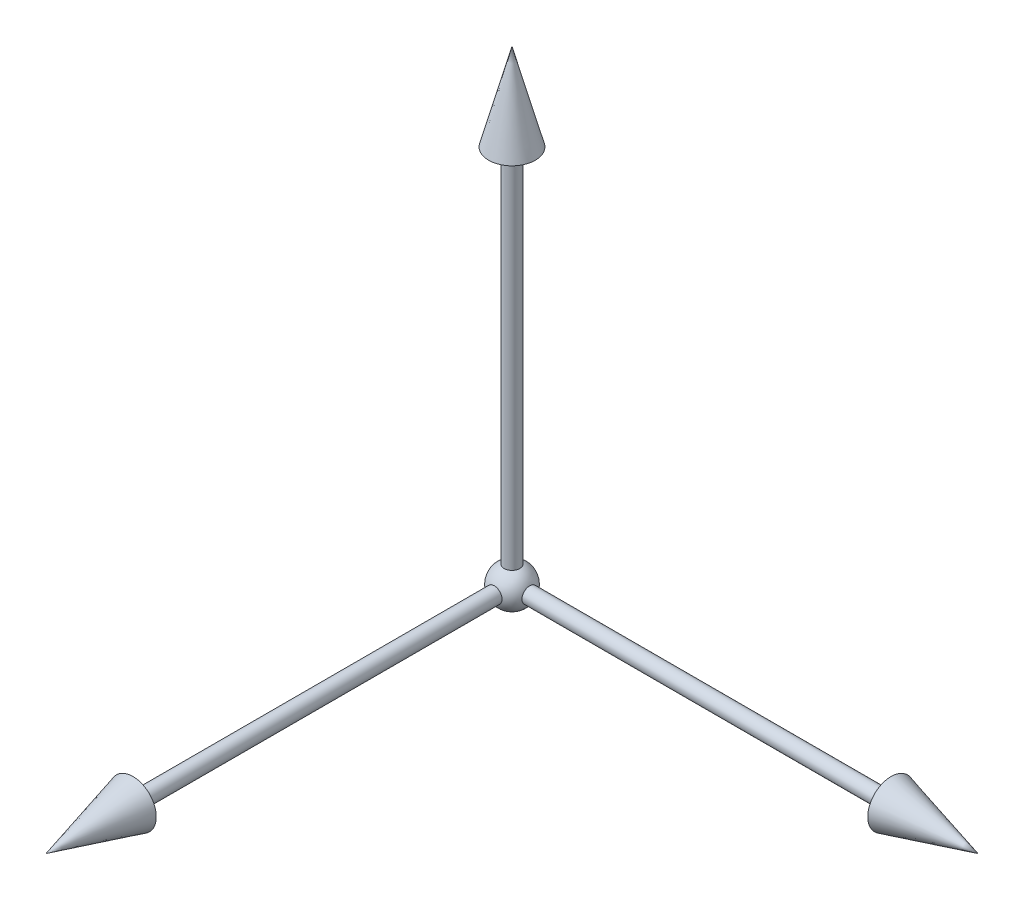
ISO-10303-21;
HEADER;
FILE_DESCRIPTION(('STEP AP214'),'2;1');
FILE_NAME('part.step','',(''),(''),'','','');
FILE_SCHEMA(('AUTOMOTIVE_DESIGN { 1 0 10303 214 1 1 1 1 }'));
ENDSEC;
DATA;
#1=APPLICATION_CONTEXT('core data for automotive mechanical design processes');
#2=APPLICATION_PROTOCOL_DEFINITION('international standard','automotive_design',2000,#1);
#3=PRODUCT_CONTEXT('',#1,'mechanical');
#4=PRODUCT('Part','Part','',(#3));
#5=PRODUCT_RELATED_PRODUCT_CATEGORY('part','',(#4));
#6=PRODUCT_DEFINITION_FORMATION('','',#4);
#7=PRODUCT_DEFINITION_CONTEXT('part definition',#1,'design');
#8=PRODUCT_DEFINITION('design','',#6,#7);
#9=PRODUCT_DEFINITION_SHAPE('','',#8);
#10=(LENGTH_UNIT() NAMED_UNIT(*) SI_UNIT(.MILLI.,.METRE.));
#11=(NAMED_UNIT(*) PLANE_ANGLE_UNIT() SI_UNIT($,.RADIAN.));
#12=(NAMED_UNIT(*) SI_UNIT($,.STERADIAN.) SOLID_ANGLE_UNIT());
#13=UNCERTAINTY_MEASURE_WITH_UNIT(LENGTH_MEASURE(1.E-05),#10,'distance_accuracy_value','');
#14=(GEOMETRIC_REPRESENTATION_CONTEXT(3) GLOBAL_UNCERTAINTY_ASSIGNED_CONTEXT((#13)) GLOBAL_UNIT_ASSIGNED_CONTEXT((#10,
#11,#12)) REPRESENTATION_CONTEXT('',''));
#15=CARTESIAN_POINT('',(0.,0.,0.));
#16=DIRECTION('',(0.,0.,1.));
#17=DIRECTION('',(1.,0.,0.));
#18=AXIS2_PLACEMENT_3D('',#15,#16,#17);
#19=CARTESIAN_POINT('',(0.,0.,0.));
#20=DIRECTION('',(0.,1.,0.));
#21=DIRECTION('',(1.,0.,0.));
#22=AXIS2_PLACEMENT_3D('',#19,#20,#21);
#23=SPHERICAL_SURFACE('',#22,1.25000000000001);
#24=CARTESIAN_POINT('',(0.,1.25000000000001,0.));
#25=VERTEX_POINT('',#24);
#26=VERTEX_LOOP('',#25);
#27=FACE_BOUND('',#26,.T.);
#28=ADVANCED_FACE('F43',(#27),#23,.T.);
#29=CLOSED_SHELL('',(#28));
#30=MANIFOLD_SOLID_BREP('B2',#29);
#31=CARTESIAN_POINT('',(0.,0.,0.));
#32=DIRECTION('',(-1.,0.,0.));
#33=DIRECTION('',(0.,0.,-1.));
#34=AXIS2_PLACEMENT_3D('',#31,#32,#33);
#35=PLANE('',#34);
#36=CARTESIAN_POINT('',(0.,0.,0.));
#37=DIRECTION('',(-1.,0.,0.));
#38=DIRECTION('',(0.,0.,-1.));
#39=AXIS2_PLACEMENT_3D('',#36,#37,#38);
#40=CIRCLE('',#39,0.500000000000014);
#41=CARTESIAN_POINT('',(0.,0.,-0.500000000000014));
#42=VERTEX_POINT('',#41);
#43=EDGE_CURVE('E87',#42,#42,#40,.T.);
#44=ORIENTED_EDGE('',*,*,#43,.T.);
#45=EDGE_LOOP('',(#44));
#46=FACE_BOUND('',#45,.T.);
#47=ADVANCED_FACE('F65',(#46),#35,.T.);
#48=CARTESIAN_POINT('',(24.4019237886467,0.,0.));
#49=DIRECTION('',(-1.,0.,0.));
#50=DIRECTION('',(0.,0.,-1.));
#51=AXIS2_PLACEMENT_3D('',#48,#49,#50);
#52=CONICAL_SURFACE('',#51,1.5,0.261799387799151);
#53=CARTESIAN_POINT('',(30.,-1.04744440165294E-13,0.));
#54=VERTEX_POINT('',#53);
#55=VERTEX_LOOP('',#54);
#56=FACE_BOUND('',#55,.T.);
#57=CARTESIAN_POINT('',(24.4019237886467,0.,0.));
#58=DIRECTION('',(-1.,0.,0.));
#59=DIRECTION('',(0.,0.,-1.));
#60=AXIS2_PLACEMENT_3D('',#57,#58,#59);
#61=CIRCLE('',#60,1.5);
#62=CARTESIAN_POINT('',(24.4019237886467,0.,-1.5));
#63=VERTEX_POINT('',#62);
#64=EDGE_CURVE('E41',#63,#63,#61,.T.);
#65=ORIENTED_EDGE('',*,*,#64,.F.);
#66=EDGE_LOOP('',(#65));
#67=FACE_BOUND('',#66,.T.);
#68=ADVANCED_FACE('F74',(#56,#67),#52,.T.);
#69=CARTESIAN_POINT('',(24.4019237886467,-1.50000000000009,0.));
#70=DIRECTION('',(-1.,0.,0.));
#71=DIRECTION('',(0.,0.,-1.));
#72=AXIS2_PLACEMENT_3D('',#69,#70,#71);
#73=PLANE('',#72);
#74=ORIENTED_EDGE('',*,*,#64,.T.);
#75=EDGE_LOOP('',(#74));
#76=FACE_BOUND('',#75,.T.);
#77=CARTESIAN_POINT('',(24.4019237886467,0.,0.));
#78=DIRECTION('',(-1.,0.,0.));
#79=DIRECTION('',(0.,0.,-1.));
#80=AXIS2_PLACEMENT_3D('',#77,#78,#79);
#81=CIRCLE('',#80,0.500000000000006);
#82=CARTESIAN_POINT('',(24.4019237886467,0.,-0.500000000000006));
#83=VERTEX_POINT('',#82);
#84=EDGE_CURVE('E71',#83,#83,#81,.T.);
#85=ORIENTED_EDGE('',*,*,#84,.F.);
#86=EDGE_LOOP('',(#85));
#87=FACE_BOUND('',#86,.T.);
#88=ADVANCED_FACE('F77',(#76,#87),#73,.T.);
#89=CARTESIAN_POINT('',(0.,0.,0.));
#90=DIRECTION('',(-1.,0.,0.));
#91=DIRECTION('',(0.,0.,-1.));
#92=AXIS2_PLACEMENT_3D('',#89,#90,#91);
#93=CYLINDRICAL_SURFACE('',#92,0.50000000000001);
#94=ORIENTED_EDGE('',*,*,#84,.T.);
#95=EDGE_LOOP('',(#94));
#96=FACE_BOUND('',#95,.T.);
#97=ORIENTED_EDGE('',*,*,#43,.F.);
#98=EDGE_LOOP('',(#97));
#99=FACE_BOUND('',#98,.T.);
#100=ADVANCED_FACE('F82',(#96,#99),#93,.T.);
#101=CLOSED_SHELL('',(#47,#68,#88,#100));
#102=MANIFOLD_SOLID_BREP('B6',#101);
#103=CARTESIAN_POINT('',(0.,0.,0.));
#104=DIRECTION('',(0.,0.,-1.));
#105=DIRECTION('',(0.,1.,0.));
#106=AXIS2_PLACEMENT_3D('',#103,#104,#105);
#107=PLANE('',#106);
#108=CARTESIAN_POINT('',(0.,0.,0.));
#109=DIRECTION('',(0.,0.,-1.));
#110=DIRECTION('',(0.,1.,0.));
#111=AXIS2_PLACEMENT_3D('',#108,#109,#110);
#112=CIRCLE('',#111,0.500000000000014);
#113=CARTESIAN_POINT('',(0.,0.500000000000014,0.));
#114=VERTEX_POINT('',#113);
#115=EDGE_CURVE('E174',#114,#114,#112,.T.);
#116=ORIENTED_EDGE('',*,*,#115,.T.);
#117=EDGE_LOOP('',(#116));
#118=FACE_BOUND('',#117,.T.);
#119=ADVANCED_FACE('F152',(#118),#107,.T.);
#120=CARTESIAN_POINT('',(0.,0.,24.4019237886467));
#121=DIRECTION('',(0.,0.,-1.));
#122=DIRECTION('',(0.,1.,0.));
#123=AXIS2_PLACEMENT_3D('',#120,#121,#122);
#124=CONICAL_SURFACE('',#123,1.5,0.261799387799151);
#125=CARTESIAN_POINT('',(0.,-1.04744440165294E-13,30.));
#126=VERTEX_POINT('',#125);
#127=VERTEX_LOOP('',#126);
#128=FACE_BOUND('',#127,.T.);
#129=CARTESIAN_POINT('',(0.,0.,24.4019237886467));
#130=DIRECTION('',(0.,0.,-1.));
#131=DIRECTION('',(0.,1.,0.));
#132=AXIS2_PLACEMENT_3D('',#129,#130,#131);
#133=CIRCLE('',#132,1.5);
#134=CARTESIAN_POINT('',(0.,1.49999999999991,24.4019237886467));
#135=VERTEX_POINT('',#134);
#136=EDGE_CURVE('E63',#135,#135,#133,.T.);
#137=ORIENTED_EDGE('',*,*,#136,.F.);
#138=EDGE_LOOP('',(#137));
#139=FACE_BOUND('',#138,.T.);
#140=ADVANCED_FACE('F161',(#128,#139),#124,.T.);
#141=CARTESIAN_POINT('',(1.5,0.,24.4019237886467));
#142=DIRECTION('',(0.,0.,-1.));
#143=DIRECTION('',(0.,1.,0.));
#144=AXIS2_PLACEMENT_3D('',#141,#142,#143);
#145=PLANE('',#144);
#146=ORIENTED_EDGE('',*,*,#136,.T.);
#147=EDGE_LOOP('',(#146));
#148=FACE_BOUND('',#147,.T.);
#149=CARTESIAN_POINT('',(0.,0.,24.4019237886467));
#150=DIRECTION('',(0.,0.,-1.));
#151=DIRECTION('',(0.,1.,0.));
#152=AXIS2_PLACEMENT_3D('',#149,#150,#151);
#153=CIRCLE('',#152,0.500000000000006);
#154=CARTESIAN_POINT('',(0.,0.499999999999921,24.4019237886467));
#155=VERTEX_POINT('',#154);
#156=EDGE_CURVE('E158',#155,#155,#153,.T.);
#157=ORIENTED_EDGE('',*,*,#156,.F.);
#158=EDGE_LOOP('',(#157));
#159=FACE_BOUND('',#158,.T.);
#160=ADVANCED_FACE('F164',(#148,#159),#145,.T.);
#161=CARTESIAN_POINT('',(0.,0.,0.));
#162=DIRECTION('',(0.,0.,-1.));
#163=DIRECTION('',(0.,1.,0.));
#164=AXIS2_PLACEMENT_3D('',#161,#162,#163);
#165=CYLINDRICAL_SURFACE('',#164,0.50000000000001);
#166=ORIENTED_EDGE('',*,*,#156,.T.);
#167=EDGE_LOOP('',(#166));
#168=FACE_BOUND('',#167,.T.);
#169=ORIENTED_EDGE('',*,*,#115,.F.);
#170=EDGE_LOOP('',(#169));
#171=FACE_BOUND('',#170,.T.);
#172=ADVANCED_FACE('F169',(#168,#171),#165,.T.);
#173=CLOSED_SHELL('',(#119,#140,#160,#172));
#174=MANIFOLD_SOLID_BREP('B35',#173);
#175=CARTESIAN_POINT('',(0.,0.,0.));
#176=DIRECTION('',(0.,-1.,0.));
#177=DIRECTION('',(0.,0.,-1.));
#178=AXIS2_PLACEMENT_3D('',#175,#176,#177);
#179=PLANE('',#178);
#180=CARTESIAN_POINT('',(0.,0.,0.));
#181=DIRECTION('',(0.,-1.,0.));
#182=DIRECTION('',(0.,0.,-1.));
#183=AXIS2_PLACEMENT_3D('',#180,#181,#182);
#184=CIRCLE('',#183,0.500000000000014);
#185=CARTESIAN_POINT('',(0.,0.,-0.500000000000014));
#186=VERTEX_POINT('',#185);
#187=EDGE_CURVE('E252',#186,#186,#184,.T.);
#188=ORIENTED_EDGE('',*,*,#187,.T.);
#189=EDGE_LOOP('',(#188));
#190=FACE_BOUND('',#189,.T.);
#191=ADVANCED_FACE('F230',(#190),#179,.T.);
#192=CARTESIAN_POINT('',(0.,24.4019237886467,0.));
#193=DIRECTION('',(0.,-1.,0.));
#194=DIRECTION('',(0.,0.,-1.));
#195=AXIS2_PLACEMENT_3D('',#192,#193,#194);
#196=CONICAL_SURFACE('',#195,1.5,0.261799387799151);
#197=CARTESIAN_POINT('',(0.,30.,0.));
#198=VERTEX_POINT('',#197);
#199=VERTEX_LOOP('',#198);
#200=FACE_BOUND('',#199,.T.);
#201=CARTESIAN_POINT('',(0.,24.4019237886467,0.));
#202=DIRECTION('',(0.,-1.,0.));
#203=DIRECTION('',(0.,0.,-1.));
#204=AXIS2_PLACEMENT_3D('',#201,#202,#203);
#205=CIRCLE('',#204,1.5);
#206=CARTESIAN_POINT('',(0.,24.4019237886467,-1.5));
#207=VERTEX_POINT('',#206);
#208=EDGE_CURVE('E150',#207,#207,#205,.T.);
#209=ORIENTED_EDGE('',*,*,#208,.F.);
#210=EDGE_LOOP('',(#209));
#211=FACE_BOUND('',#210,.T.);
#212=ADVANCED_FACE('F239',(#200,#211),#196,.T.);
#213=CARTESIAN_POINT('',(1.5,24.4019237886467,0.));
#214=DIRECTION('',(0.,-1.,0.));
#215=DIRECTION('',(0.,0.,-1.));
#216=AXIS2_PLACEMENT_3D('',#213,#214,#215);
#217=PLANE('',#216);
#218=ORIENTED_EDGE('',*,*,#208,.T.);
#219=EDGE_LOOP('',(#218));
#220=FACE_BOUND('',#219,.T.);
#221=CARTESIAN_POINT('',(0.,24.4019237886467,0.));
#222=DIRECTION('',(0.,-1.,0.));
#223=DIRECTION('',(0.,0.,-1.));
#224=AXIS2_PLACEMENT_3D('',#221,#222,#223);
#225=CIRCLE('',#224,0.500000000000006);
#226=CARTESIAN_POINT('',(0.,24.4019237886467,-0.500000000000006));
#227=VERTEX_POINT('',#226);
#228=EDGE_CURVE('E236',#227,#227,#225,.T.);
#229=ORIENTED_EDGE('',*,*,#228,.F.);
#230=EDGE_LOOP('',(#229));
#231=FACE_BOUND('',#230,.T.);
#232=ADVANCED_FACE('F242',(#220,#231),#217,.T.);
#233=CARTESIAN_POINT('',(0.,0.,0.));
#234=DIRECTION('',(0.,-1.,0.));
#235=DIRECTION('',(0.,0.,-1.));
#236=AXIS2_PLACEMENT_3D('',#233,#234,#235);
#237=CYLINDRICAL_SURFACE('',#236,0.50000000000001);
#238=ORIENTED_EDGE('',*,*,#228,.T.);
#239=EDGE_LOOP('',(#238));
#240=FACE_BOUND('',#239,.T.);
#241=ORIENTED_EDGE('',*,*,#187,.F.);
#242=EDGE_LOOP('',(#241));
#243=FACE_BOUND('',#242,.T.);
#244=ADVANCED_FACE('F247',(#240,#243),#237,.T.);
#245=CLOSED_SHELL('',(#191,#212,#232,#244));
#246=MANIFOLD_SOLID_BREP('B57',#245);
#247=ADVANCED_BREP_SHAPE_REPRESENTATION('',(#18,#30,#102,#174,#246),#14);
#248=SHAPE_DEFINITION_REPRESENTATION(#9,#247);
ENDSEC;
END-ISO-10303-21;
